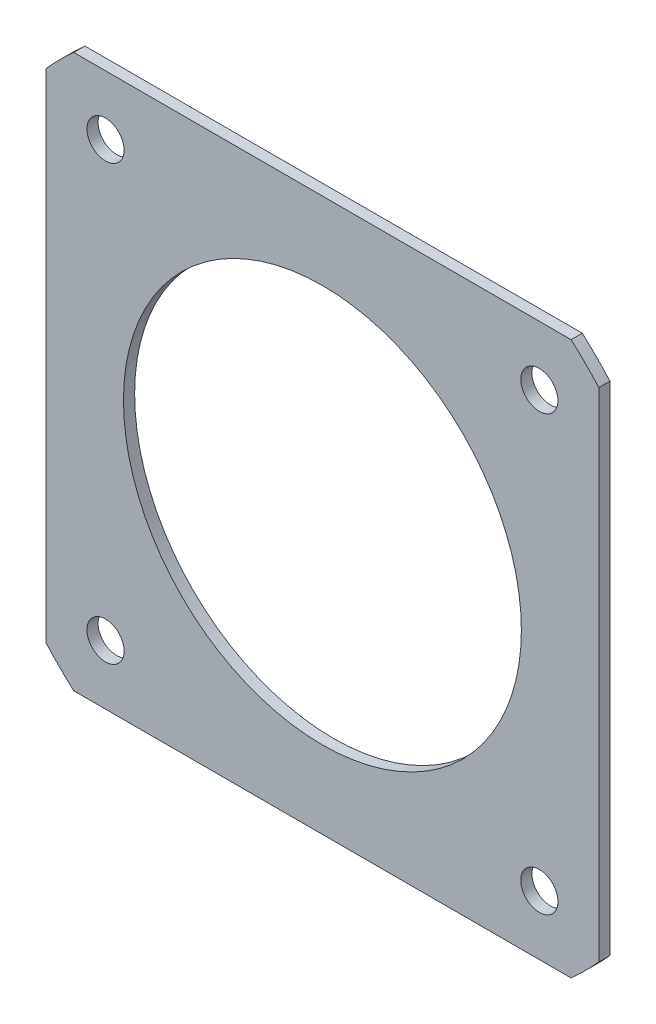
ISO-10303-21;
HEADER;
FILE_DESCRIPTION(('STEP AP214'),'2;1');
FILE_NAME('part.step','',(''),(''),'','','');
FILE_SCHEMA(('AUTOMOTIVE_DESIGN { 1 0 10303 214 1 1 1 1 }'));
ENDSEC;
DATA;
#1=APPLICATION_CONTEXT('core data for automotive mechanical design processes');
#2=APPLICATION_PROTOCOL_DEFINITION('international standard','automotive_design',2000,#1);
#3=PRODUCT_CONTEXT('',#1,'mechanical');
#4=PRODUCT('Part','Part','',(#3));
#5=PRODUCT_RELATED_PRODUCT_CATEGORY('part','',(#4));
#6=PRODUCT_DEFINITION_FORMATION('','',#4);
#7=PRODUCT_DEFINITION_CONTEXT('part definition',#1,'design');
#8=PRODUCT_DEFINITION('design','',#6,#7);
#9=PRODUCT_DEFINITION_SHAPE('','',#8);
#10=(LENGTH_UNIT() NAMED_UNIT(*) SI_UNIT(.MILLI.,.METRE.));
#11=(NAMED_UNIT(*) PLANE_ANGLE_UNIT() SI_UNIT($,.RADIAN.));
#12=(NAMED_UNIT(*) SI_UNIT($,.STERADIAN.) SOLID_ANGLE_UNIT());
#13=UNCERTAINTY_MEASURE_WITH_UNIT(LENGTH_MEASURE(1.E-05),#10,'distance_accuracy_value','');
#14=(GEOMETRIC_REPRESENTATION_CONTEXT(3) GLOBAL_UNCERTAINTY_ASSIGNED_CONTEXT((#13)) GLOBAL_UNIT_ASSIGNED_CONTEXT((#10,
#11,#12)) REPRESENTATION_CONTEXT('',''));
#15=CARTESIAN_POINT('',(0.,0.,0.));
#16=DIRECTION('',(0.,0.,1.));
#17=DIRECTION('',(1.,0.,0.));
#18=AXIS2_PLACEMENT_3D('',#15,#16,#17);
#19=CARTESIAN_POINT('',(0.,135.,3.));
#20=DIRECTION('',(0.,0.,1.));
#21=DIRECTION('',(1.,0.,0.));
#22=AXIS2_PLACEMENT_3D('',#19,#20,#21);
#23=PLANE('',#22);
#24=CARTESIAN_POINT('',(58.3363094478901,193.33630944789,3.));
#25=DIRECTION('',(0.,0.,1.));
#26=DIRECTION('',(1.,0.,0.));
#27=AXIS2_PLACEMENT_3D('',#24,#25,#26);
#28=CIRCLE('',#27,5.00000000000001);
#29=CARTESIAN_POINT('',(63.3363094478901,193.33630944789,3.));
#30=VERTEX_POINT('',#29);
#31=EDGE_CURVE('E197',#30,#30,#28,.T.);
#32=ORIENTED_EDGE('',*,*,#31,.F.);
#33=EDGE_LOOP('',(#32));
#34=FACE_BOUND('',#33,.T.);
#35=CARTESIAN_POINT('',(-58.3363094478901,76.6636905521097,3.));
#36=DIRECTION('',(0.,0.,1.));
#37=DIRECTION('',(1.,0.,0.));
#38=AXIS2_PLACEMENT_3D('',#35,#36,#37);
#39=CIRCLE('',#38,4.99999999999999);
#40=CARTESIAN_POINT('',(-53.3363094478901,76.6636905521097,3.));
#41=VERTEX_POINT('',#40);
#42=EDGE_CURVE('E185',#41,#41,#39,.T.);
#43=ORIENTED_EDGE('',*,*,#42,.F.);
#44=EDGE_LOOP('',(#43));
#45=FACE_BOUND('',#44,.T.);
#46=CARTESIAN_POINT('',(0.,135.,3.));
#47=DIRECTION('',(0.,0.,1.));
#48=DIRECTION('',(1.,0.,0.));
#49=AXIS2_PLACEMENT_3D('',#46,#47,#48);
#50=CIRCLE('',#49,100.);
#51=CARTESIAN_POINT('',(-74.33630944789,68.1111885464577,3.));
#52=VERTEX_POINT('',#51);
#53=CARTESIAN_POINT('',(-66.8888114535423,60.66369055211,3.));
#54=VERTEX_POINT('',#53);
#55=EDGE_CURVE('E148',#52,#54,#50,.T.);
#56=ORIENTED_EDGE('',*,*,#55,.T.);
#57=DIRECTION('',(1.,0.,0.));
#58=VECTOR('',#57,1.);
#59=CARTESIAN_POINT('',(66.8888114535423,60.66369055211,3.));
#60=LINE('',#59,#58);
#61=CARTESIAN_POINT('',(66.8888114535423,60.66369055211,3.));
#62=VERTEX_POINT('',#61);
#63=EDGE_CURVE('E96',#54,#62,#60,.T.);
#64=ORIENTED_EDGE('',*,*,#63,.T.);
#65=CARTESIAN_POINT('',(0.,135.,3.));
#66=DIRECTION('',(0.,0.,1.));
#67=DIRECTION('',(1.,0.,0.));
#68=AXIS2_PLACEMENT_3D('',#65,#66,#67);
#69=CIRCLE('',#68,100.);
#70=CARTESIAN_POINT('',(74.3363094478901,68.1111885464577,3.));
#71=VERTEX_POINT('',#70);
#72=EDGE_CURVE('E163',#62,#71,#69,.T.);
#73=ORIENTED_EDGE('',*,*,#72,.T.);
#74=DIRECTION('',(0.,1.,0.));
#75=VECTOR('',#74,1.);
#76=CARTESIAN_POINT('',(74.3363094478901,201.888811453542,3.));
#77=LINE('',#76,#75);
#78=CARTESIAN_POINT('',(74.3363094478901,201.888811453542,3.));
#79=VERTEX_POINT('',#78);
#80=EDGE_CURVE('E176',#71,#79,#77,.T.);
#81=ORIENTED_EDGE('',*,*,#80,.T.);
#82=CARTESIAN_POINT('',(0.,135.,3.));
#83=DIRECTION('',(0.,0.,1.));
#84=DIRECTION('',(1.,0.,0.));
#85=AXIS2_PLACEMENT_3D('',#82,#83,#84);
#86=CIRCLE('',#85,100.);
#87=CARTESIAN_POINT('',(66.888811453542,209.33630944789,3.));
#88=VERTEX_POINT('',#87);
#89=EDGE_CURVE('E115',#79,#88,#86,.T.);
#90=ORIENTED_EDGE('',*,*,#89,.T.);
#91=DIRECTION('',(-1.,0.,0.));
#92=VECTOR('',#91,1.);
#93=CARTESIAN_POINT('',(-66.888811453542,209.33630944789,3.));
#94=LINE('',#93,#92);
#95=CARTESIAN_POINT('',(-66.888811453542,209.33630944789,3.));
#96=VERTEX_POINT('',#95);
#97=EDGE_CURVE('E109',#88,#96,#94,.T.);
#98=ORIENTED_EDGE('',*,*,#97,.T.);
#99=CARTESIAN_POINT('',(0.,135.,3.));
#100=DIRECTION('',(0.,0.,1.));
#101=DIRECTION('',(1.,0.,0.));
#102=AXIS2_PLACEMENT_3D('',#99,#100,#101);
#103=CIRCLE('',#102,100.);
#104=CARTESIAN_POINT('',(-74.33630944789,201.888811453542,3.));
#105=VERTEX_POINT('',#104);
#106=EDGE_CURVE('E113',#96,#105,#103,.T.);
#107=ORIENTED_EDGE('',*,*,#106,.T.);
#108=DIRECTION('',(0.,-1.,0.));
#109=VECTOR('',#108,1.);
#110=CARTESIAN_POINT('',(-74.33630944789,68.1111885464577,3.));
#111=LINE('',#110,#109);
#112=EDGE_CURVE('E53',#105,#52,#111,.T.);
#113=ORIENTED_EDGE('',*,*,#112,.T.);
#114=EDGE_LOOP('',(#56,#64,#73,#81,#90,#98,#107,#113));
#115=FACE_BOUND('',#114,.T.);
#116=CARTESIAN_POINT('',(0.,135.,3.));
#117=DIRECTION('',(0.,0.,1.));
#118=DIRECTION('',(1.,0.,0.));
#119=AXIS2_PLACEMENT_3D('',#116,#117,#118);
#120=CIRCLE('',#119,53.5);
#121=CARTESIAN_POINT('',(53.5,135.,3.));
#122=VERTEX_POINT('',#121);
#123=EDGE_CURVE('E137',#122,#122,#120,.T.);
#124=ORIENTED_EDGE('',*,*,#123,.F.);
#125=EDGE_LOOP('',(#124));
#126=FACE_BOUND('',#125,.T.);
#127=CARTESIAN_POINT('',(58.3363094478903,76.6636905521099,3.));
#128=DIRECTION('',(0.,0.,1.));
#129=DIRECTION('',(1.,0.,0.));
#130=AXIS2_PLACEMENT_3D('',#127,#128,#129);
#131=CIRCLE('',#130,4.99999999999999);
#132=CARTESIAN_POINT('',(63.3363094478903,76.6636905521099,3.));
#133=VERTEX_POINT('',#132);
#134=EDGE_CURVE('E191',#133,#133,#131,.T.);
#135=ORIENTED_EDGE('',*,*,#134,.F.);
#136=EDGE_LOOP('',(#135));
#137=FACE_BOUND('',#136,.T.);
#138=CARTESIAN_POINT('',(-58.3363094478903,193.33630944789,3.));
#139=DIRECTION('',(0.,0.,1.));
#140=DIRECTION('',(1.,0.,0.));
#141=AXIS2_PLACEMENT_3D('',#138,#139,#140);
#142=CIRCLE('',#141,4.99999999999996);
#143=CARTESIAN_POINT('',(-53.3363094478903,193.33630944789,3.));
#144=VERTEX_POINT('',#143);
#145=EDGE_CURVE('E203',#144,#144,#142,.T.);
#146=ORIENTED_EDGE('',*,*,#145,.F.);
#147=EDGE_LOOP('',(#146));
#148=FACE_BOUND('',#147,.T.);
#149=ADVANCED_FACE('F36',(#34,#45,#115,#126,#137,#148),#23,.T.);
#150=CARTESIAN_POINT('',(0.,135.,0.));
#151=DIRECTION('',(0.,0.,1.));
#152=DIRECTION('',(1.,0.,0.));
#153=AXIS2_PLACEMENT_3D('',#150,#151,#152);
#154=PLANE('',#153);
#155=CARTESIAN_POINT('',(0.,135.,0.));
#156=DIRECTION('',(0.,0.,1.));
#157=DIRECTION('',(1.,0.,0.));
#158=AXIS2_PLACEMENT_3D('',#155,#156,#157);
#159=CIRCLE('',#158,100.);
#160=CARTESIAN_POINT('',(-74.33630944789,68.1111885464577,0.));
#161=VERTEX_POINT('',#160);
#162=CARTESIAN_POINT('',(-66.8888114535423,60.66369055211,0.));
#163=VERTEX_POINT('',#162);
#164=EDGE_CURVE('E133',#161,#163,#159,.T.);
#165=ORIENTED_EDGE('',*,*,#164,.F.);
#166=DIRECTION('',(0.,-1.,0.));
#167=VECTOR('',#166,1.);
#168=CARTESIAN_POINT('',(-74.33630944789,68.1111885464577,0.));
#169=LINE('',#168,#167);
#170=CARTESIAN_POINT('',(-74.33630944789,201.888811453542,0.));
#171=VERTEX_POINT('',#170);
#172=EDGE_CURVE('E88',#171,#161,#169,.T.);
#173=ORIENTED_EDGE('',*,*,#172,.F.);
#174=CARTESIAN_POINT('',(0.,135.,0.));
#175=DIRECTION('',(0.,0.,1.));
#176=DIRECTION('',(1.,0.,0.));
#177=AXIS2_PLACEMENT_3D('',#174,#175,#176);
#178=CIRCLE('',#177,100.);
#179=CARTESIAN_POINT('',(-66.888811453542,209.33630944789,0.));
#180=VERTEX_POINT('',#179);
#181=EDGE_CURVE('E82',#180,#171,#178,.T.);
#182=ORIENTED_EDGE('',*,*,#181,.F.);
#183=DIRECTION('',(-1.,0.,0.));
#184=VECTOR('',#183,1.);
#185=CARTESIAN_POINT('',(-66.888811453542,209.33630944789,0.));
#186=LINE('',#185,#184);
#187=CARTESIAN_POINT('',(66.888811453542,209.33630944789,0.));
#188=VERTEX_POINT('',#187);
#189=EDGE_CURVE('E123',#188,#180,#186,.T.);
#190=ORIENTED_EDGE('',*,*,#189,.F.);
#191=CARTESIAN_POINT('',(0.,135.,0.));
#192=DIRECTION('',(0.,0.,1.));
#193=DIRECTION('',(1.,0.,0.));
#194=AXIS2_PLACEMENT_3D('',#191,#192,#193);
#195=CIRCLE('',#194,100.);
#196=CARTESIAN_POINT('',(74.3363094478901,201.888811453542,0.));
#197=VERTEX_POINT('',#196);
#198=EDGE_CURVE('E143',#197,#188,#195,.T.);
#199=ORIENTED_EDGE('',*,*,#198,.F.);
#200=DIRECTION('',(0.,1.,0.));
#201=VECTOR('',#200,1.);
#202=CARTESIAN_POINT('',(74.3363094478901,201.888811453542,0.));
#203=LINE('',#202,#201);
#204=CARTESIAN_POINT('',(74.3363094478901,68.1111885464577,0.));
#205=VERTEX_POINT('',#204);
#206=EDGE_CURVE('E141',#205,#197,#203,.T.);
#207=ORIENTED_EDGE('',*,*,#206,.F.);
#208=CARTESIAN_POINT('',(0.,135.,0.));
#209=DIRECTION('',(0.,0.,1.));
#210=DIRECTION('',(1.,0.,0.));
#211=AXIS2_PLACEMENT_3D('',#208,#209,#210);
#212=CIRCLE('',#211,100.);
#213=CARTESIAN_POINT('',(66.8888114535423,60.66369055211,0.));
#214=VERTEX_POINT('',#213);
#215=EDGE_CURVE('E139',#214,#205,#212,.T.);
#216=ORIENTED_EDGE('',*,*,#215,.F.);
#217=DIRECTION('',(1.,0.,0.));
#218=VECTOR('',#217,1.);
#219=CARTESIAN_POINT('',(66.8888114535423,60.66369055211,0.));
#220=LINE('',#219,#218);
#221=EDGE_CURVE('E136',#163,#214,#220,.T.);
#222=ORIENTED_EDGE('',*,*,#221,.F.);
#223=EDGE_LOOP('',(#165,#173,#182,#190,#199,#207,#216,#222));
#224=FACE_BOUND('',#223,.T.);
#225=CARTESIAN_POINT('',(0.,135.,0.));
#226=DIRECTION('',(0.,0.,1.));
#227=DIRECTION('',(1.,0.,0.));
#228=AXIS2_PLACEMENT_3D('',#225,#226,#227);
#229=CIRCLE('',#228,53.5);
#230=CARTESIAN_POINT('',(53.5,135.,0.));
#231=VERTEX_POINT('',#230);
#232=EDGE_CURVE('E182',#231,#231,#229,.T.);
#233=ORIENTED_EDGE('',*,*,#232,.T.);
#234=EDGE_LOOP('',(#233));
#235=FACE_BOUND('',#234,.T.);
#236=CARTESIAN_POINT('',(-58.3363094478901,76.6636905521097,0.));
#237=DIRECTION('',(0.,0.,1.));
#238=DIRECTION('',(1.,0.,0.));
#239=AXIS2_PLACEMENT_3D('',#236,#237,#238);
#240=CIRCLE('',#239,4.99999999999999);
#241=CARTESIAN_POINT('',(-53.3363094478901,76.6636905521097,0.));
#242=VERTEX_POINT('',#241);
#243=EDGE_CURVE('E188',#242,#242,#240,.T.);
#244=ORIENTED_EDGE('',*,*,#243,.T.);
#245=EDGE_LOOP('',(#244));
#246=FACE_BOUND('',#245,.T.);
#247=CARTESIAN_POINT('',(58.3363094478903,76.6636905521099,0.));
#248=DIRECTION('',(0.,0.,1.));
#249=DIRECTION('',(1.,0.,0.));
#250=AXIS2_PLACEMENT_3D('',#247,#248,#249);
#251=CIRCLE('',#250,4.99999999999999);
#252=CARTESIAN_POINT('',(63.3363094478903,76.6636905521099,0.));
#253=VERTEX_POINT('',#252);
#254=EDGE_CURVE('E194',#253,#253,#251,.T.);
#255=ORIENTED_EDGE('',*,*,#254,.T.);
#256=EDGE_LOOP('',(#255));
#257=FACE_BOUND('',#256,.T.);
#258=CARTESIAN_POINT('',(58.3363094478901,193.33630944789,0.));
#259=DIRECTION('',(0.,0.,1.));
#260=DIRECTION('',(1.,0.,0.));
#261=AXIS2_PLACEMENT_3D('',#258,#259,#260);
#262=CIRCLE('',#261,5.00000000000001);
#263=CARTESIAN_POINT('',(63.3363094478901,193.33630944789,0.));
#264=VERTEX_POINT('',#263);
#265=EDGE_CURVE('E200',#264,#264,#262,.T.);
#266=ORIENTED_EDGE('',*,*,#265,.T.);
#267=EDGE_LOOP('',(#266));
#268=FACE_BOUND('',#267,.T.);
#269=CARTESIAN_POINT('',(-58.3363094478903,193.33630944789,0.));
#270=DIRECTION('',(0.,0.,1.));
#271=DIRECTION('',(1.,0.,0.));
#272=AXIS2_PLACEMENT_3D('',#269,#270,#271);
#273=CIRCLE('',#272,4.99999999999996);
#274=CARTESIAN_POINT('',(-53.3363094478903,193.33630944789,0.));
#275=VERTEX_POINT('',#274);
#276=EDGE_CURVE('E206',#275,#275,#273,.T.);
#277=ORIENTED_EDGE('',*,*,#276,.T.);
#278=EDGE_LOOP('',(#277));
#279=FACE_BOUND('',#278,.T.);
#280=ADVANCED_FACE('F167',(#224,#235,#246,#257,#268,#279),#154,.F.);
#281=CARTESIAN_POINT('',(0.,135.,3.));
#282=DIRECTION('',(0.,0.,-1.));
#283=DIRECTION('',(-1.,0.,0.));
#284=AXIS2_PLACEMENT_3D('',#281,#282,#283);
#285=CYLINDRICAL_SURFACE('',#284,100.);
#286=ORIENTED_EDGE('',*,*,#164,.T.);
#287=DIRECTION('',(0.,0.,-1.));
#288=VECTOR('',#287,1.);
#289=CARTESIAN_POINT('',(-66.8888114535423,60.66369055211,3.));
#290=LINE('',#289,#288);
#291=EDGE_CURVE('E11',#54,#163,#290,.T.);
#292=ORIENTED_EDGE('',*,*,#291,.F.);
#293=ORIENTED_EDGE('',*,*,#55,.F.);
#294=DIRECTION('',(0.,0.,-1.));
#295=VECTOR('',#294,1.);
#296=CARTESIAN_POINT('',(-74.33630944789,68.1111885464577,3.));
#297=LINE('',#296,#295);
#298=EDGE_CURVE('E129',#52,#161,#297,.T.);
#299=ORIENTED_EDGE('',*,*,#298,.T.);
#300=EDGE_LOOP('',(#286,#292,#293,#299));
#301=FACE_BOUND('',#300,.T.);
#302=ADVANCED_FACE('F38',(#301),#285,.T.);
#303=CARTESIAN_POINT('',(66.8888114535423,60.66369055211,3.));
#304=DIRECTION('',(0.,1.,0.));
#305=DIRECTION('',(0.,0.,1.));
#306=AXIS2_PLACEMENT_3D('',#303,#304,#305);
#307=PLANE('',#306);
#308=ORIENTED_EDGE('',*,*,#221,.T.);
#309=DIRECTION('',(0.,0.,-1.));
#310=VECTOR('',#309,1.);
#311=CARTESIAN_POINT('',(66.8888114535423,60.66369055211,3.));
#312=LINE('',#311,#310);
#313=EDGE_CURVE('E45',#62,#214,#312,.T.);
#314=ORIENTED_EDGE('',*,*,#313,.F.);
#315=ORIENTED_EDGE('',*,*,#63,.F.);
#316=ORIENTED_EDGE('',*,*,#291,.T.);
#317=EDGE_LOOP('',(#308,#314,#315,#316));
#318=FACE_BOUND('',#317,.T.);
#319=ADVANCED_FACE('F240',(#318),#307,.F.);
#320=CARTESIAN_POINT('',(0.,135.,3.));
#321=DIRECTION('',(0.,0.,-1.));
#322=DIRECTION('',(-1.,0.,0.));
#323=AXIS2_PLACEMENT_3D('',#320,#321,#322);
#324=CYLINDRICAL_SURFACE('',#323,100.);
#325=ORIENTED_EDGE('',*,*,#215,.T.);
#326=DIRECTION('',(0.,0.,-1.));
#327=VECTOR('',#326,1.);
#328=CARTESIAN_POINT('',(74.3363094478901,68.1111885464577,3.));
#329=LINE('',#328,#327);
#330=EDGE_CURVE('E155',#71,#205,#329,.T.);
#331=ORIENTED_EDGE('',*,*,#330,.F.);
#332=ORIENTED_EDGE('',*,*,#72,.F.);
#333=ORIENTED_EDGE('',*,*,#313,.T.);
#334=EDGE_LOOP('',(#325,#331,#332,#333));
#335=FACE_BOUND('',#334,.T.);
#336=ADVANCED_FACE('F161',(#335),#324,.T.);
#337=CARTESIAN_POINT('',(74.3363094478901,201.888811453542,3.));
#338=DIRECTION('',(-1.,0.,0.));
#339=DIRECTION('',(0.,0.,1.));
#340=AXIS2_PLACEMENT_3D('',#337,#338,#339);
#341=PLANE('',#340);
#342=ORIENTED_EDGE('',*,*,#206,.T.);
#343=DIRECTION('',(0.,0.,-1.));
#344=VECTOR('',#343,1.);
#345=CARTESIAN_POINT('',(74.3363094478901,201.888811453542,3.));
#346=LINE('',#345,#344);
#347=EDGE_CURVE('E152',#79,#197,#346,.T.);
#348=ORIENTED_EDGE('',*,*,#347,.F.);
#349=ORIENTED_EDGE('',*,*,#80,.F.);
#350=ORIENTED_EDGE('',*,*,#330,.T.);
#351=EDGE_LOOP('',(#342,#348,#349,#350));
#352=FACE_BOUND('',#351,.T.);
#353=ADVANCED_FACE('F172',(#352),#341,.F.);
#354=CARTESIAN_POINT('',(0.,135.,3.));
#355=DIRECTION('',(0.,0.,-1.));
#356=DIRECTION('',(-1.,0.,0.));
#357=AXIS2_PLACEMENT_3D('',#354,#355,#356);
#358=CYLINDRICAL_SURFACE('',#357,100.);
#359=ORIENTED_EDGE('',*,*,#198,.T.);
#360=DIRECTION('',(0.,0.,-1.));
#361=VECTOR('',#360,1.);
#362=CARTESIAN_POINT('',(66.888811453542,209.33630944789,3.));
#363=LINE('',#362,#361);
#364=EDGE_CURVE('E124',#88,#188,#363,.T.);
#365=ORIENTED_EDGE('',*,*,#364,.F.);
#366=ORIENTED_EDGE('',*,*,#89,.F.);
#367=ORIENTED_EDGE('',*,*,#347,.T.);
#368=EDGE_LOOP('',(#359,#365,#366,#367));
#369=FACE_BOUND('',#368,.T.);
#370=ADVANCED_FACE('F175',(#369),#358,.T.);
#371=CARTESIAN_POINT('',(-66.888811453542,209.33630944789,3.));
#372=DIRECTION('',(0.,-1.,0.));
#373=DIRECTION('',(0.,0.,-1.));
#374=AXIS2_PLACEMENT_3D('',#371,#372,#373);
#375=PLANE('',#374);
#376=ORIENTED_EDGE('',*,*,#189,.T.);
#377=DIRECTION('',(0.,0.,-1.));
#378=VECTOR('',#377,1.);
#379=CARTESIAN_POINT('',(-66.888811453542,209.33630944789,3.));
#380=LINE('',#379,#378);
#381=EDGE_CURVE('E120',#96,#180,#380,.T.);
#382=ORIENTED_EDGE('',*,*,#381,.F.);
#383=ORIENTED_EDGE('',*,*,#97,.F.);
#384=ORIENTED_EDGE('',*,*,#364,.T.);
#385=EDGE_LOOP('',(#376,#382,#383,#384));
#386=FACE_BOUND('',#385,.T.);
#387=ADVANCED_FACE('F121',(#386),#375,.F.);
#388=CARTESIAN_POINT('',(0.,135.,3.));
#389=DIRECTION('',(0.,0.,-1.));
#390=DIRECTION('',(-1.,0.,0.));
#391=AXIS2_PLACEMENT_3D('',#388,#389,#390);
#392=CYLINDRICAL_SURFACE('',#391,100.);
#393=ORIENTED_EDGE('',*,*,#181,.T.);
#394=DIRECTION('',(0.,0.,-1.));
#395=VECTOR('',#394,1.);
#396=CARTESIAN_POINT('',(-74.33630944789,201.888811453542,3.));
#397=LINE('',#396,#395);
#398=EDGE_CURVE('E125',#105,#171,#397,.T.);
#399=ORIENTED_EDGE('',*,*,#398,.F.);
#400=ORIENTED_EDGE('',*,*,#106,.F.);
#401=ORIENTED_EDGE('',*,*,#381,.T.);
#402=EDGE_LOOP('',(#393,#399,#400,#401));
#403=FACE_BOUND('',#402,.T.);
#404=ADVANCED_FACE('F127',(#403),#392,.T.);
#405=CARTESIAN_POINT('',(-74.33630944789,68.1111885464577,3.));
#406=DIRECTION('',(1.,0.,0.));
#407=DIRECTION('',(0.,0.,-1.));
#408=AXIS2_PLACEMENT_3D('',#405,#406,#407);
#409=PLANE('',#408);
#410=ORIENTED_EDGE('',*,*,#172,.T.);
#411=ORIENTED_EDGE('',*,*,#298,.F.);
#412=ORIENTED_EDGE('',*,*,#112,.F.);
#413=ORIENTED_EDGE('',*,*,#398,.T.);
#414=EDGE_LOOP('',(#410,#411,#412,#413));
#415=FACE_BOUND('',#414,.T.);
#416=ADVANCED_FACE('F228',(#415),#409,.F.);
#417=CARTESIAN_POINT('',(0.,135.,3.));
#418=DIRECTION('',(0.,0.,-1.));
#419=DIRECTION('',(-1.,0.,0.));
#420=AXIS2_PLACEMENT_3D('',#417,#418,#419);
#421=CYLINDRICAL_SURFACE('',#420,53.5);
#422=ORIENTED_EDGE('',*,*,#123,.T.);
#423=EDGE_LOOP('',(#422));
#424=FACE_BOUND('',#423,.T.);
#425=ORIENTED_EDGE('',*,*,#232,.F.);
#426=EDGE_LOOP('',(#425));
#427=FACE_BOUND('',#426,.T.);
#428=ADVANCED_FACE('F225',(#424,#427),#421,.F.);
#429=CARTESIAN_POINT('',(-58.3363094478901,76.6636905521097,3.));
#430=DIRECTION('',(0.,0.,-1.));
#431=DIRECTION('',(-1.,0.,0.));
#432=AXIS2_PLACEMENT_3D('',#429,#430,#431);
#433=CYLINDRICAL_SURFACE('',#432,4.99999999999999);
#434=ORIENTED_EDGE('',*,*,#42,.T.);
#435=EDGE_LOOP('',(#434));
#436=FACE_BOUND('',#435,.T.);
#437=ORIENTED_EDGE('',*,*,#243,.F.);
#438=EDGE_LOOP('',(#437));
#439=FACE_BOUND('',#438,.T.);
#440=ADVANCED_FACE('F316',(#436,#439),#433,.F.);
#441=CARTESIAN_POINT('',(58.3363094478903,76.6636905521099,3.));
#442=DIRECTION('',(0.,0.,-1.));
#443=DIRECTION('',(-1.,0.,0.));
#444=AXIS2_PLACEMENT_3D('',#441,#442,#443);
#445=CYLINDRICAL_SURFACE('',#444,4.99999999999999);
#446=ORIENTED_EDGE('',*,*,#134,.T.);
#447=EDGE_LOOP('',(#446));
#448=FACE_BOUND('',#447,.T.);
#449=ORIENTED_EDGE('',*,*,#254,.F.);
#450=EDGE_LOOP('',(#449));
#451=FACE_BOUND('',#450,.T.);
#452=ADVANCED_FACE('F325',(#448,#451),#445,.F.);
#453=CARTESIAN_POINT('',(58.3363094478901,193.33630944789,3.));
#454=DIRECTION('',(0.,0.,-1.));
#455=DIRECTION('',(-1.,0.,0.));
#456=AXIS2_PLACEMENT_3D('',#453,#454,#455);
#457=CYLINDRICAL_SURFACE('',#456,5.00000000000001);
#458=ORIENTED_EDGE('',*,*,#31,.T.);
#459=EDGE_LOOP('',(#458));
#460=FACE_BOUND('',#459,.T.);
#461=ORIENTED_EDGE('',*,*,#265,.F.);
#462=EDGE_LOOP('',(#461));
#463=FACE_BOUND('',#462,.T.);
#464=ADVANCED_FACE('F334',(#460,#463),#457,.F.);
#465=CARTESIAN_POINT('',(-58.3363094478903,193.33630944789,3.));
#466=DIRECTION('',(0.,0.,-1.));
#467=DIRECTION('',(-1.,0.,0.));
#468=AXIS2_PLACEMENT_3D('',#465,#466,#467);
#469=CYLINDRICAL_SURFACE('',#468,4.99999999999996);
#470=ORIENTED_EDGE('',*,*,#145,.T.);
#471=EDGE_LOOP('',(#470));
#472=FACE_BOUND('',#471,.T.);
#473=ORIENTED_EDGE('',*,*,#276,.F.);
#474=EDGE_LOOP('',(#473));
#475=FACE_BOUND('',#474,.T.);
#476=ADVANCED_FACE('F212',(#472,#475),#469,.F.);
#477=CLOSED_SHELL('',(#149,#280,#302,#319,#336,#353,#370,#387,#404,#416,#428,#440,#452,#464,#476));
#478=MANIFOLD_SOLID_BREP('B2',#477);
#479=ADVANCED_BREP_SHAPE_REPRESENTATION('',(#18,#478),#14);
#480=SHAPE_DEFINITION_REPRESENTATION(#9,#479);
ENDSEC;
END-ISO-10303-21;
